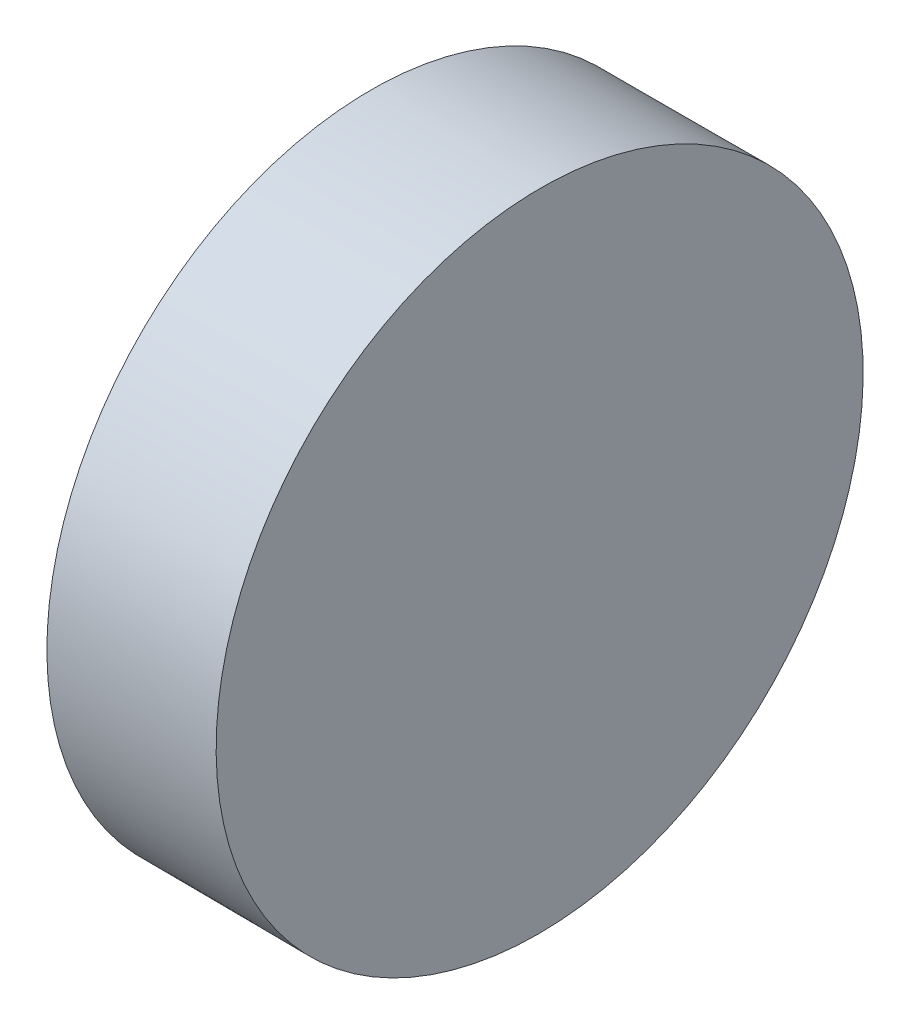
ISO-10303-21;
HEADER;
FILE_DESCRIPTION(('STEP AP214'),'2;1');
FILE_NAME('part.step','',(''),(''),'','','');
FILE_SCHEMA(('AUTOMOTIVE_DESIGN { 1 0 10303 214 1 1 1 1 }'));
ENDSEC;
DATA;
#1=APPLICATION_CONTEXT('core data for automotive mechanical design processes');
#2=APPLICATION_PROTOCOL_DEFINITION('international standard','automotive_design',2000,#1);
#3=PRODUCT_CONTEXT('',#1,'mechanical');
#4=PRODUCT('Part','Part','',(#3));
#5=PRODUCT_RELATED_PRODUCT_CATEGORY('part','',(#4));
#6=PRODUCT_DEFINITION_FORMATION('','',#4);
#7=PRODUCT_DEFINITION_CONTEXT('part definition',#1,'design');
#8=PRODUCT_DEFINITION('design','',#6,#7);
#9=PRODUCT_DEFINITION_SHAPE('','',#8);
#10=(LENGTH_UNIT() NAMED_UNIT(*) SI_UNIT(.MILLI.,.METRE.));
#11=(NAMED_UNIT(*) PLANE_ANGLE_UNIT() SI_UNIT($,.RADIAN.));
#12=(NAMED_UNIT(*) SI_UNIT($,.STERADIAN.) SOLID_ANGLE_UNIT());
#13=UNCERTAINTY_MEASURE_WITH_UNIT(LENGTH_MEASURE(1.E-05),#10,'distance_accuracy_value','');
#14=(GEOMETRIC_REPRESENTATION_CONTEXT(3) GLOBAL_UNCERTAINTY_ASSIGNED_CONTEXT((#13)) GLOBAL_UNIT_ASSIGNED_CONTEXT((#10,
#11,#12)) REPRESENTATION_CONTEXT('',''));
#15=CARTESIAN_POINT('',(0.,0.,0.));
#16=DIRECTION('',(0.,0.,1.));
#17=DIRECTION('',(1.,0.,0.));
#18=AXIS2_PLACEMENT_3D('',#15,#16,#17);
#19=CARTESIAN_POINT('',(270.16153123816,77.2405604302059,0.));
#20=DIRECTION('',(-0.999994699357882,0.00325595702371825,0.));
#21=DIRECTION('',(-0.00325595702371825,-0.999994699357882,0.));
#22=AXIS2_PLACEMENT_3D('',#19,#20,#21);
#23=CONICAL_SURFACE('',#22,0.0526191977250268,1.56754036401828);
#24=CARTESIAN_POINT('',(270.099668382624,77.2407618540726,0.));
#25=DIRECTION('',(-0.999994699357882,0.00325595702371825,0.));
#26=DIRECTION('',(-0.00325595702371825,-0.999994699357882,0.));
#27=AXIS2_PLACEMENT_3D('',#24,#25,#26);
#28=CIRCLE('',#27,19.0525184855248);
#29=CARTESIAN_POINT('',(270.037634201242,58.1883443591297,0.));
#30=VERTEX_POINT('',#29);
#31=EDGE_CURVE('E11',#30,#30,#28,.T.);
#32=ORIENTED_EDGE('',*,*,#31,.F.);
#33=EDGE_LOOP('',(#32));
#34=FACE_BOUND('',#33,.T.);
#35=CARTESIAN_POINT('',(270.161702564007,77.2405598723734,0.));
#36=VERTEX_POINT('',#35);
#37=VERTEX_LOOP('',#36);
#38=FACE_BOUND('',#37,.T.);
#39=ADVANCED_FACE('F37',(#34,#38),#23,.T.);
#40=CARTESIAN_POINT('',(270.099668382624,77.2407618540726,0.));
#41=DIRECTION('',(0.999994699357882,-0.00325595702371825,0.));
#42=DIRECTION('',(0.00325595702371825,0.999994699357882,0.));
#43=AXIS2_PLACEMENT_3D('',#40,#41,#42);
#44=CONICAL_SURFACE('',#43,19.0525184855248,0.00325596277661802);
#45=CARTESIAN_POINT('',(260.099774395186,77.2733212517231,0.));
#46=DIRECTION('',(-0.999994699357882,0.00325595702371825,0.));
#47=DIRECTION('',(-0.00325595702371825,-0.999994699357882,0.));
#48=AXIS2_PLACEMENT_3D('',#45,#46,#47);
#49=CIRCLE('',#48,19.0199589152876);
#50=CARTESIAN_POINT('',(260.037846226365,58.2534631544308,0.));
#51=VERTEX_POINT('',#50);
#52=EDGE_CURVE('E44',#51,#51,#49,.T.);
#53=ORIENTED_EDGE('',*,*,#52,.F.);
#54=EDGE_LOOP('',(#53));
#55=FACE_BOUND('',#54,.T.);
#56=ORIENTED_EDGE('',*,*,#31,.T.);
#57=EDGE_LOOP('',(#56));
#58=FACE_BOUND('',#57,.T.);
#59=ADVANCED_FACE('F51',(#55,#58),#44,.T.);
#60=CARTESIAN_POINT('',(260.161637250722,77.2731198278565,0.));
#61=DIRECTION('',(-0.999994699357882,0.00325595702371825,0.));
#62=DIRECTION('',(-0.00325595702371825,-0.999994699357882,0.));
#63=AXIS2_PLACEMENT_3D('',#60,#61,#62);
#64=CONICAL_SURFACE('',#63,0.0200596274878446,1.56754036401876);
#65=CARTESIAN_POINT('',(260.161702564007,77.2731196151981,0.));
#66=VERTEX_POINT('',#65);
#67=VERTEX_LOOP('',#66);
#68=FACE_BOUND('',#67,.T.);
#69=ORIENTED_EDGE('',*,*,#52,.T.);
#70=EDGE_LOOP('',(#69));
#71=FACE_BOUND('',#70,.T.);
#72=ADVANCED_FACE('F56',(#68,#71),#64,.F.);
#73=CLOSED_SHELL('',(#39,#59,#72));
#74=MANIFOLD_SOLID_BREP('B2',#73);
#75=ADVANCED_BREP_SHAPE_REPRESENTATION('',(#18,#74),#14);
#76=SHAPE_DEFINITION_REPRESENTATION(#9,#75);
ENDSEC;
END-ISO-10303-21;
